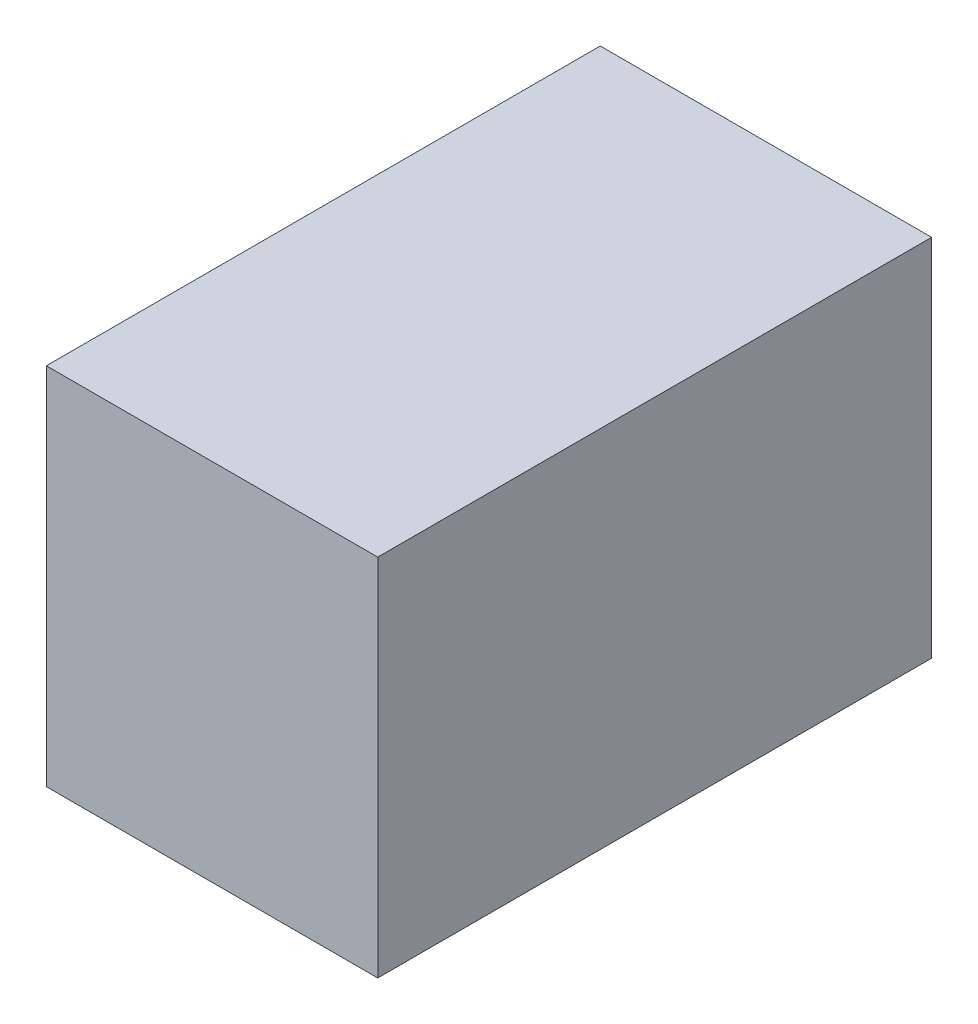
ISO-10303-21;
HEADER;
FILE_DESCRIPTION(('STEP AP214'),'2;1');
FILE_NAME('part.step','',(''),(''),'','','');
FILE_SCHEMA(('AUTOMOTIVE_DESIGN { 1 0 10303 214 1 1 1 1 }'));
ENDSEC;
DATA;
#1=APPLICATION_CONTEXT('core data for automotive mechanical design processes');
#2=APPLICATION_PROTOCOL_DEFINITION('international standard','automotive_design',2000,#1);
#3=PRODUCT_CONTEXT('',#1,'mechanical');
#4=PRODUCT('Part','Part','',(#3));
#5=PRODUCT_RELATED_PRODUCT_CATEGORY('part','',(#4));
#6=PRODUCT_DEFINITION_FORMATION('','',#4);
#7=PRODUCT_DEFINITION_CONTEXT('part definition',#1,'design');
#8=PRODUCT_DEFINITION('design','',#6,#7);
#9=PRODUCT_DEFINITION_SHAPE('','',#8);
#10=(LENGTH_UNIT() NAMED_UNIT(*) SI_UNIT(.MILLI.,.METRE.));
#11=(NAMED_UNIT(*) PLANE_ANGLE_UNIT() SI_UNIT($,.RADIAN.));
#12=(NAMED_UNIT(*) SI_UNIT($,.STERADIAN.) SOLID_ANGLE_UNIT());
#13=UNCERTAINTY_MEASURE_WITH_UNIT(LENGTH_MEASURE(1.E-05),#10,'distance_accuracy_value','');
#14=(GEOMETRIC_REPRESENTATION_CONTEXT(3) GLOBAL_UNCERTAINTY_ASSIGNED_CONTEXT((#13)) GLOBAL_UNIT_ASSIGNED_CONTEXT((#10,
#11,#12)) REPRESENTATION_CONTEXT('',''));
#15=CARTESIAN_POINT('',(0.,0.,0.));
#16=DIRECTION('',(0.,0.,1.));
#17=DIRECTION('',(1.,0.,0.));
#18=AXIS2_PLACEMENT_3D('',#15,#16,#17);
#19=CARTESIAN_POINT('',(19.,9.55,-17.55));
#20=DIRECTION('',(0.,0.,1.));
#21=DIRECTION('',(1.,0.,0.));
#22=AXIS2_PLACEMENT_3D('',#19,#20,#21);
#23=PLANE('',#22);
#24=DIRECTION('',(0.,-1.,0.));
#25=VECTOR('',#24,1.);
#26=CARTESIAN_POINT('',(12.,9.55,-17.55));
#27=LINE('',#26,#25);
#28=CARTESIAN_POINT('',(12.,9.55,-17.55));
#29=VERTEX_POINT('',#28);
#30=CARTESIAN_POINT('',(12.,-9.55,-17.55));
#31=VERTEX_POINT('',#30);
#32=EDGE_CURVE('E202',#29,#31,#27,.T.);
#33=ORIENTED_EDGE('',*,*,#32,.F.);
#34=DIRECTION('',(1.,0.,0.));
#35=VECTOR('',#34,1.);
#36=CARTESIAN_POINT('',(0.,9.55,-17.55));
#37=LINE('',#36,#35);
#38=CARTESIAN_POINT('',(0.,9.55,-17.55));
#39=VERTEX_POINT('',#38);
#40=EDGE_CURVE('E206',#39,#29,#37,.T.);
#41=ORIENTED_EDGE('',*,*,#40,.F.);
#42=DIRECTION('',(0.,1.,0.));
#43=VECTOR('',#42,1.);
#44=CARTESIAN_POINT('',(0.,9.55,-17.55));
#45=LINE('',#44,#43);
#46=CARTESIAN_POINT('',(0.,11.55,-17.55));
#47=VERTEX_POINT('',#46);
#48=EDGE_CURVE('E92',#39,#47,#45,.T.);
#49=ORIENTED_EDGE('',*,*,#48,.T.);
#50=DIRECTION('',(-1.,0.,0.));
#51=VECTOR('',#50,1.);
#52=CARTESIAN_POINT('',(19.,11.55,-17.55));
#53=LINE('',#52,#51);
#54=CARTESIAN_POINT('',(21.,11.55,-17.55));
#55=VERTEX_POINT('',#54);
#56=EDGE_CURVE('E11',#55,#47,#53,.T.);
#57=ORIENTED_EDGE('',*,*,#56,.F.);
#58=DIRECTION('',(0.,1.,0.));
#59=VECTOR('',#58,1.);
#60=CARTESIAN_POINT('',(21.,9.55,-17.55));
#61=LINE('',#60,#59);
#62=CARTESIAN_POINT('',(21.,-11.55,-17.55));
#63=VERTEX_POINT('',#62);
#64=EDGE_CURVE('E120',#63,#55,#61,.T.);
#65=ORIENTED_EDGE('',*,*,#64,.F.);
#66=DIRECTION('',(-1.,0.,0.));
#67=VECTOR('',#66,1.);
#68=CARTESIAN_POINT('',(19.,-11.55,-17.55));
#69=LINE('',#68,#67);
#70=CARTESIAN_POINT('',(0.,-11.55,-17.55));
#71=VERTEX_POINT('',#70);
#72=EDGE_CURVE('E136',#63,#71,#69,.T.);
#73=ORIENTED_EDGE('',*,*,#72,.T.);
#74=CARTESIAN_POINT('',(0.,-9.55,-17.55));
#75=VERTEX_POINT('',#74);
#76=EDGE_CURVE('E140',#71,#75,#45,.T.);
#77=ORIENTED_EDGE('',*,*,#76,.T.);
#78=DIRECTION('',(-1.,0.,0.));
#79=VECTOR('',#78,1.);
#80=CARTESIAN_POINT('',(12.,-9.55,-17.55));
#81=LINE('',#80,#79);
#82=EDGE_CURVE('E198',#31,#75,#81,.T.);
#83=ORIENTED_EDGE('',*,*,#82,.F.);
#84=EDGE_LOOP('',(#33,#41,#49,#57,#65,#73,#77,#83));
#85=FACE_BOUND('',#84,.T.);
#86=ADVANCED_FACE('F43',(#85),#23,.F.);
#87=CARTESIAN_POINT('',(19.,11.55,15.55));
#88=DIRECTION('',(0.,-1.,0.));
#89=DIRECTION('',(0.,0.,-1.));
#90=AXIS2_PLACEMENT_3D('',#87,#88,#89);
#91=PLANE('',#90);
#92=DIRECTION('',(0.,0.,1.));
#93=VECTOR('',#92,1.);
#94=CARTESIAN_POINT('',(0.,11.55,15.55));
#95=LINE('',#94,#93);
#96=CARTESIAN_POINT('',(0.,11.55,17.55));
#97=VERTEX_POINT('',#96);
#98=EDGE_CURVE('E47',#47,#97,#95,.T.);
#99=ORIENTED_EDGE('',*,*,#98,.T.);
#100=DIRECTION('',(-1.,0.,0.));
#101=VECTOR('',#100,1.);
#102=CARTESIAN_POINT('',(19.,11.55,17.55));
#103=LINE('',#102,#101);
#104=CARTESIAN_POINT('',(21.,11.55,17.55));
#105=VERTEX_POINT('',#104);
#106=EDGE_CURVE('E53',#105,#97,#103,.T.);
#107=ORIENTED_EDGE('',*,*,#106,.F.);
#108=DIRECTION('',(0.,0.,1.));
#109=VECTOR('',#108,1.);
#110=CARTESIAN_POINT('',(21.,11.55,15.55));
#111=LINE('',#110,#109);
#112=EDGE_CURVE('E114',#55,#105,#111,.T.);
#113=ORIENTED_EDGE('',*,*,#112,.F.);
#114=ORIENTED_EDGE('',*,*,#56,.T.);
#115=EDGE_LOOP('',(#99,#107,#113,#114));
#116=FACE_BOUND('',#115,.T.);
#117=ADVANCED_FACE('F125',(#116),#91,.F.);
#118=CARTESIAN_POINT('',(19.,9.55,17.55));
#119=DIRECTION('',(0.,0.,-1.));
#120=DIRECTION('',(0.,1.,0.));
#121=AXIS2_PLACEMENT_3D('',#118,#119,#120);
#122=PLANE('',#121);
#123=DIRECTION('',(0.,-1.,0.));
#124=VECTOR('',#123,1.);
#125=CARTESIAN_POINT('',(0.,9.55,17.55));
#126=LINE('',#125,#124);
#127=CARTESIAN_POINT('',(0.,-11.55,17.55));
#128=VERTEX_POINT('',#127);
#129=EDGE_CURVE('E146',#97,#128,#126,.T.);
#130=ORIENTED_EDGE('',*,*,#129,.T.);
#131=DIRECTION('',(-1.,0.,0.));
#132=VECTOR('',#131,1.);
#133=CARTESIAN_POINT('',(19.,-11.55,17.55));
#134=LINE('',#133,#132);
#135=CARTESIAN_POINT('',(21.,-11.55,17.55));
#136=VERTEX_POINT('',#135);
#137=EDGE_CURVE('E129',#136,#128,#134,.T.);
#138=ORIENTED_EDGE('',*,*,#137,.F.);
#139=DIRECTION('',(0.,-1.,0.));
#140=VECTOR('',#139,1.);
#141=CARTESIAN_POINT('',(21.,9.55,17.55));
#142=LINE('',#141,#140);
#143=EDGE_CURVE('E117',#105,#136,#142,.T.);
#144=ORIENTED_EDGE('',*,*,#143,.F.);
#145=ORIENTED_EDGE('',*,*,#106,.T.);
#146=EDGE_LOOP('',(#130,#138,#144,#145));
#147=FACE_BOUND('',#146,.T.);
#148=ADVANCED_FACE('F131',(#147),#122,.F.);
#149=CARTESIAN_POINT('',(19.,-11.55,15.55));
#150=DIRECTION('',(0.,1.,0.));
#151=DIRECTION('',(0.,0.,1.));
#152=AXIS2_PLACEMENT_3D('',#149,#150,#151);
#153=PLANE('',#152);
#154=DIRECTION('',(0.,0.,-1.));
#155=VECTOR('',#154,1.);
#156=CARTESIAN_POINT('',(0.,-11.55,15.55));
#157=LINE('',#156,#155);
#158=EDGE_CURVE('E144',#128,#71,#157,.T.);
#159=ORIENTED_EDGE('',*,*,#158,.T.);
#160=ORIENTED_EDGE('',*,*,#72,.F.);
#161=DIRECTION('',(0.,0.,-1.));
#162=VECTOR('',#161,1.);
#163=CARTESIAN_POINT('',(21.,-11.55,15.55));
#164=LINE('',#163,#162);
#165=EDGE_CURVE('E70',#136,#63,#164,.T.);
#166=ORIENTED_EDGE('',*,*,#165,.F.);
#167=ORIENTED_EDGE('',*,*,#137,.T.);
#168=EDGE_LOOP('',(#159,#160,#166,#167));
#169=FACE_BOUND('',#168,.T.);
#170=ADVANCED_FACE('F224',(#169),#153,.F.);
#171=CARTESIAN_POINT('',(21.,0.,0.));
#172=DIRECTION('',(1.,0.,0.));
#173=DIRECTION('',(0.,0.,-1.));
#174=AXIS2_PLACEMENT_3D('',#171,#172,#173);
#175=PLANE('',#174);
#176=ORIENTED_EDGE('',*,*,#64,.T.);
#177=ORIENTED_EDGE('',*,*,#112,.T.);
#178=ORIENTED_EDGE('',*,*,#143,.T.);
#179=ORIENTED_EDGE('',*,*,#165,.T.);
#180=EDGE_LOOP('',(#176,#177,#178,#179));
#181=FACE_BOUND('',#180,.T.);
#182=ADVANCED_FACE('F45',(#181),#175,.T.);
#183=CARTESIAN_POINT('',(0.,0.,0.));
#184=DIRECTION('',(1.,0.,0.));
#185=DIRECTION('',(0.,0.,-1.));
#186=AXIS2_PLACEMENT_3D('',#183,#184,#185);
#187=PLANE('',#186);
#188=ORIENTED_EDGE('',*,*,#48,.F.);
#189=DIRECTION('',(0.,0.,1.));
#190=VECTOR('',#189,1.);
#191=CARTESIAN_POINT('',(0.,9.55,15.55));
#192=LINE('',#191,#190);
#193=CARTESIAN_POINT('',(0.,9.55,15.55));
#194=VERTEX_POINT('',#193);
#195=EDGE_CURVE('E182',#39,#194,#192,.T.);
#196=ORIENTED_EDGE('',*,*,#195,.T.);
#197=DIRECTION('',(0.,-1.,0.));
#198=VECTOR('',#197,1.);
#199=CARTESIAN_POINT('',(0.,9.55,15.55));
#200=LINE('',#199,#198);
#201=CARTESIAN_POINT('',(0.,-9.55,15.55));
#202=VERTEX_POINT('',#201);
#203=EDGE_CURVE('E61',#194,#202,#200,.T.);
#204=ORIENTED_EDGE('',*,*,#203,.T.);
#205=DIRECTION('',(0.,0.,-1.));
#206=VECTOR('',#205,1.);
#207=CARTESIAN_POINT('',(0.,-9.55,15.55));
#208=LINE('',#207,#206);
#209=EDGE_CURVE('E176',#202,#75,#208,.T.);
#210=ORIENTED_EDGE('',*,*,#209,.T.);
#211=ORIENTED_EDGE('',*,*,#76,.F.);
#212=ORIENTED_EDGE('',*,*,#158,.F.);
#213=ORIENTED_EDGE('',*,*,#129,.F.);
#214=ORIENTED_EDGE('',*,*,#98,.F.);
#215=EDGE_LOOP('',(#188,#196,#204,#210,#211,#212,#213,#214));
#216=FACE_BOUND('',#215,.T.);
#217=ADVANCED_FACE('F226',(#216),#187,.F.);
#218=CARTESIAN_POINT('',(19.,9.55,-15.55));
#219=DIRECTION('',(0.,0.,1.));
#220=DIRECTION('',(1.,0.,0.));
#221=AXIS2_PLACEMENT_3D('',#218,#219,#220);
#222=PLANE('',#221);
#223=DIRECTION('',(0.,-1.,0.));
#224=VECTOR('',#223,1.);
#225=CARTESIAN_POINT('',(12.,9.54999999999999,-15.55));
#226=LINE('',#225,#224);
#227=CARTESIAN_POINT('',(12.,9.55,-15.55));
#228=VERTEX_POINT('',#227);
#229=CARTESIAN_POINT('',(12.,-9.55,-15.55));
#230=VERTEX_POINT('',#229);
#231=EDGE_CURVE('E190',#228,#230,#226,.T.);
#232=ORIENTED_EDGE('',*,*,#231,.T.);
#233=DIRECTION('',(-1.,0.,0.));
#234=VECTOR('',#233,1.);
#235=CARTESIAN_POINT('',(19.,-9.55,-15.55));
#236=LINE('',#235,#234);
#237=CARTESIAN_POINT('',(19.,-9.55,-15.55));
#238=VERTEX_POINT('',#237);
#239=EDGE_CURVE('E160',#238,#230,#236,.T.);
#240=ORIENTED_EDGE('',*,*,#239,.F.);
#241=DIRECTION('',(0.,1.,0.));
#242=VECTOR('',#241,1.);
#243=CARTESIAN_POINT('',(19.,9.55,-15.55));
#244=LINE('',#243,#242);
#245=CARTESIAN_POINT('',(19.,9.55,-15.55));
#246=VERTEX_POINT('',#245);
#247=EDGE_CURVE('E172',#238,#246,#244,.T.);
#248=ORIENTED_EDGE('',*,*,#247,.T.);
#249=DIRECTION('',(-1.,0.,0.));
#250=VECTOR('',#249,1.);
#251=CARTESIAN_POINT('',(19.,9.55,-15.55));
#252=LINE('',#251,#250);
#253=EDGE_CURVE('E151',#246,#228,#252,.T.);
#254=ORIENTED_EDGE('',*,*,#253,.T.);
#255=EDGE_LOOP('',(#232,#240,#248,#254));
#256=FACE_BOUND('',#255,.T.);
#257=ADVANCED_FACE('F250',(#256),#222,.T.);
#258=CARTESIAN_POINT('',(19.,9.55,15.55));
#259=DIRECTION('',(0.,-1.,0.));
#260=DIRECTION('',(0.,0.,-1.));
#261=AXIS2_PLACEMENT_3D('',#258,#259,#260);
#262=PLANE('',#261);
#263=ORIENTED_EDGE('',*,*,#195,.F.);
#264=ORIENTED_EDGE('',*,*,#40,.T.);
#265=DIRECTION('',(0.,0.,-1.));
#266=VECTOR('',#265,1.);
#267=CARTESIAN_POINT('',(12.,9.54999999999999,7.00681715136246));
#268=LINE('',#267,#266);
#269=EDGE_CURVE('E194',#228,#29,#268,.T.);
#270=ORIENTED_EDGE('',*,*,#269,.F.);
#271=ORIENTED_EDGE('',*,*,#253,.F.);
#272=DIRECTION('',(0.,0.,1.));
#273=VECTOR('',#272,1.);
#274=CARTESIAN_POINT('',(19.,9.55,15.55));
#275=LINE('',#274,#273);
#276=CARTESIAN_POINT('',(19.,9.55,15.55));
#277=VERTEX_POINT('',#276);
#278=EDGE_CURVE('E168',#246,#277,#275,.T.);
#279=ORIENTED_EDGE('',*,*,#278,.T.);
#280=DIRECTION('',(-1.,0.,0.));
#281=VECTOR('',#280,1.);
#282=CARTESIAN_POINT('',(19.,9.55,15.55));
#283=LINE('',#282,#281);
#284=EDGE_CURVE('E154',#277,#194,#283,.T.);
#285=ORIENTED_EDGE('',*,*,#284,.T.);
#286=EDGE_LOOP('',(#263,#264,#270,#271,#279,#285));
#287=FACE_BOUND('',#286,.T.);
#288=ADVANCED_FACE('F243',(#287),#262,.T.);
#289=CARTESIAN_POINT('',(19.,9.55,15.55));
#290=DIRECTION('',(0.,0.,-1.));
#291=DIRECTION('',(0.,1.,0.));
#292=AXIS2_PLACEMENT_3D('',#289,#290,#291);
#293=PLANE('',#292);
#294=ORIENTED_EDGE('',*,*,#203,.F.);
#295=ORIENTED_EDGE('',*,*,#284,.F.);
#296=DIRECTION('',(0.,-1.,0.));
#297=VECTOR('',#296,1.);
#298=CARTESIAN_POINT('',(19.,9.55,15.55));
#299=LINE('',#298,#297);
#300=CARTESIAN_POINT('',(19.,-9.55,15.55));
#301=VERTEX_POINT('',#300);
#302=EDGE_CURVE('E165',#277,#301,#299,.T.);
#303=ORIENTED_EDGE('',*,*,#302,.T.);
#304=DIRECTION('',(-1.,0.,0.));
#305=VECTOR('',#304,1.);
#306=CARTESIAN_POINT('',(19.,-9.55,15.55));
#307=LINE('',#306,#305);
#308=EDGE_CURVE('E157',#301,#202,#307,.T.);
#309=ORIENTED_EDGE('',*,*,#308,.T.);
#310=EDGE_LOOP('',(#294,#295,#303,#309));
#311=FACE_BOUND('',#310,.T.);
#312=ADVANCED_FACE('F247',(#311),#293,.T.);
#313=CARTESIAN_POINT('',(19.,-9.55,15.55));
#314=DIRECTION('',(0.,1.,0.));
#315=DIRECTION('',(0.,0.,1.));
#316=AXIS2_PLACEMENT_3D('',#313,#314,#315);
#317=PLANE('',#316);
#318=ORIENTED_EDGE('',*,*,#209,.F.);
#319=ORIENTED_EDGE('',*,*,#308,.F.);
#320=DIRECTION('',(0.,0.,-1.));
#321=VECTOR('',#320,1.);
#322=CARTESIAN_POINT('',(19.,-9.55,15.55));
#323=LINE('',#322,#321);
#324=EDGE_CURVE('E101',#301,#238,#323,.T.);
#325=ORIENTED_EDGE('',*,*,#324,.T.);
#326=ORIENTED_EDGE('',*,*,#239,.T.);
#327=DIRECTION('',(0.,0.,-1.));
#328=VECTOR('',#327,1.);
#329=CARTESIAN_POINT('',(12.,-9.55,7.00681715136246));
#330=LINE('',#329,#328);
#331=EDGE_CURVE('E186',#230,#31,#330,.T.);
#332=ORIENTED_EDGE('',*,*,#331,.T.);
#333=ORIENTED_EDGE('',*,*,#82,.T.);
#334=EDGE_LOOP('',(#318,#319,#325,#326,#332,#333));
#335=FACE_BOUND('',#334,.T.);
#336=ADVANCED_FACE('F252',(#335),#317,.T.);
#337=CARTESIAN_POINT('',(19.,0.,0.));
#338=DIRECTION('',(1.,0.,0.));
#339=DIRECTION('',(0.,0.,-1.));
#340=AXIS2_PLACEMENT_3D('',#337,#338,#339);
#341=PLANE('',#340);
#342=ORIENTED_EDGE('',*,*,#247,.F.);
#343=ORIENTED_EDGE('',*,*,#324,.F.);
#344=ORIENTED_EDGE('',*,*,#302,.F.);
#345=ORIENTED_EDGE('',*,*,#278,.F.);
#346=EDGE_LOOP('',(#342,#343,#344,#345));
#347=FACE_BOUND('',#346,.T.);
#348=ADVANCED_FACE('F248',(#347),#341,.F.);
#349=CARTESIAN_POINT('',(12.,9.54999999999999,7.00681715136246));
#350=DIRECTION('',(1.,0.,0.));
#351=DIRECTION('',(0.,1.,0.));
#352=AXIS2_PLACEMENT_3D('',#349,#350,#351);
#353=PLANE('',#352);
#354=ORIENTED_EDGE('',*,*,#269,.T.);
#355=ORIENTED_EDGE('',*,*,#32,.T.);
#356=ORIENTED_EDGE('',*,*,#331,.F.);
#357=ORIENTED_EDGE('',*,*,#231,.F.);
#358=EDGE_LOOP('',(#354,#355,#356,#357));
#359=FACE_BOUND('',#358,.T.);
#360=ADVANCED_FACE('F254',(#359),#353,.F.);
#361=CLOSED_SHELL('',(#86,#117,#148,#170,#182,#217,#257,#288,#312,#336,#348,#360));
#362=MANIFOLD_SOLID_BREP('B2',#361);
#363=ADVANCED_BREP_SHAPE_REPRESENTATION('',(#18,#362),#14);
#364=SHAPE_DEFINITION_REPRESENTATION(#9,#363);
ENDSEC;
END-ISO-10303-21;
